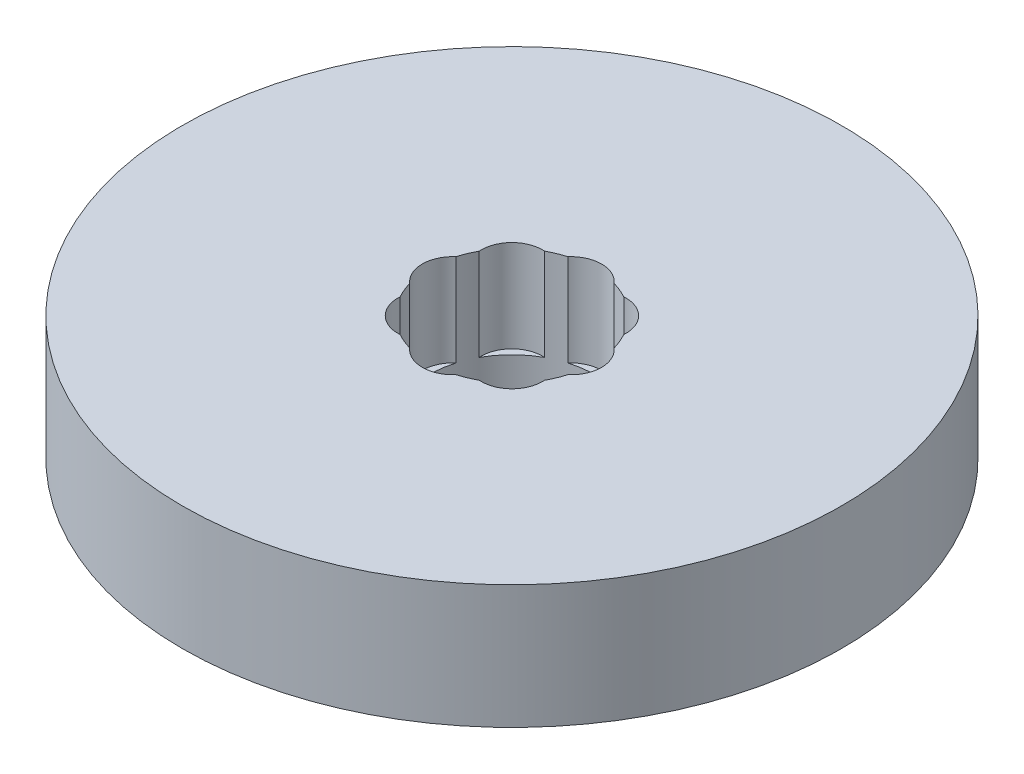
ISO-10303-21;
HEADER;
FILE_DESCRIPTION(('STEP AP214'),'2;1');
FILE_NAME('part.step','',(''),(''),'','','');
FILE_SCHEMA(('AUTOMOTIVE_DESIGN { 1 0 10303 214 1 1 1 1 }'));
ENDSEC;
DATA;
#1=APPLICATION_CONTEXT('core data for automotive mechanical design processes');
#2=APPLICATION_PROTOCOL_DEFINITION('international standard','automotive_design',2000,#1);
#3=PRODUCT_CONTEXT('',#1,'mechanical');
#4=PRODUCT('Part','Part','',(#3));
#5=PRODUCT_RELATED_PRODUCT_CATEGORY('part','',(#4));
#6=PRODUCT_DEFINITION_FORMATION('','',#4);
#7=PRODUCT_DEFINITION_CONTEXT('part definition',#1,'design');
#8=PRODUCT_DEFINITION('design','',#6,#7);
#9=PRODUCT_DEFINITION_SHAPE('','',#8);
#10=(LENGTH_UNIT() NAMED_UNIT(*) SI_UNIT(.MILLI.,.METRE.));
#11=(NAMED_UNIT(*) PLANE_ANGLE_UNIT() SI_UNIT($,.RADIAN.));
#12=(NAMED_UNIT(*) SI_UNIT($,.STERADIAN.) SOLID_ANGLE_UNIT());
#13=UNCERTAINTY_MEASURE_WITH_UNIT(LENGTH_MEASURE(1.E-05),#10,'distance_accuracy_value','');
#14=(GEOMETRIC_REPRESENTATION_CONTEXT(3) GLOBAL_UNCERTAINTY_ASSIGNED_CONTEXT((#13)) GLOBAL_UNIT_ASSIGNED_CONTEXT((#10,
#11,#12)) REPRESENTATION_CONTEXT('',''));
#15=CARTESIAN_POINT('',(0.,0.,0.));
#16=DIRECTION('',(0.,0.,1.));
#17=DIRECTION('',(1.,0.,0.));
#18=AXIS2_PLACEMENT_3D('',#15,#16,#17);
#19=CARTESIAN_POINT('',(0.,30.,0.));
#20=DIRECTION('',(0.,-1.,0.));
#21=DIRECTION('',(0.,0.,-1.));
#22=AXIS2_PLACEMENT_3D('',#19,#20,#21);
#23=CYLINDRICAL_SURFACE('',#22,80.);
#24=CARTESIAN_POINT('',(0.,30.,0.));
#25=DIRECTION('',(0.,1.,0.));
#26=DIRECTION('',(0.,0.,1.));
#27=AXIS2_PLACEMENT_3D('',#24,#25,#26);
#28=CIRCLE('',#27,80.);
#29=CARTESIAN_POINT('',(0.,30.,80.));
#30=VERTEX_POINT('',#29);
#31=EDGE_CURVE('E263',#30,#30,#28,.T.);
#32=ORIENTED_EDGE('',*,*,#31,.F.);
#33=EDGE_LOOP('',(#32));
#34=FACE_BOUND('',#33,.T.);
#35=CARTESIAN_POINT('',(0.,0.,0.));
#36=DIRECTION('',(0.,1.,0.));
#37=DIRECTION('',(0.,0.,1.));
#38=AXIS2_PLACEMENT_3D('',#35,#36,#37);
#39=CIRCLE('',#38,80.);
#40=CARTESIAN_POINT('',(0.,0.,80.));
#41=VERTEX_POINT('',#40);
#42=EDGE_CURVE('E256',#41,#41,#39,.T.);
#43=ORIENTED_EDGE('',*,*,#42,.T.);
#44=EDGE_LOOP('',(#43));
#45=FACE_BOUND('',#44,.T.);
#46=ADVANCED_FACE('F39',(#34,#45),#23,.T.);
#47=CARTESIAN_POINT('',(0.,30.,0.));
#48=DIRECTION('',(0.,1.,0.));
#49=DIRECTION('',(0.,0.,1.));
#50=AXIS2_PLACEMENT_3D('',#47,#48,#49);
#51=PLANE('',#50);
#52=CARTESIAN_POINT('',(-10.119499895816,30.,10.119499895816));
#53=DIRECTION('',(0.,1.,0.));
#54=DIRECTION('',(0.707106781186549,0.,0.707106781186546));
#55=AXIS2_PLACEMENT_3D('',#52,#53,#54);
#56=CIRCLE('',#55,7.44063860303872);
#57=CARTESIAN_POINT('',(-17.5423631982251,30.,9.60549287759661));
#58=VERTEX_POINT('',#57);
#59=CARTESIAN_POINT('',(-9.60549287759656,30.,17.5423631982251));
#60=VERTEX_POINT('',#59);
#61=EDGE_CURVE('E246',#58,#60,#56,.T.);
#62=ORIENTED_EDGE('',*,*,#61,.F.);
#63=CARTESIAN_POINT('',(0.,30.,0.));
#64=DIRECTION('',(0.,1.,0.));
#65=DIRECTION('',(0.,0.,1.));
#66=AXIS2_PLACEMENT_3D('',#63,#64,#65);
#67=CIRCLE('',#66,20.);
#68=CARTESIAN_POINT('',(-19.1964331258899,30.,5.61221482511465));
#69=VERTEX_POINT('',#68);
#70=EDGE_CURVE('E254',#69,#58,#67,.T.);
#71=ORIENTED_EDGE('',*,*,#70,.F.);
#72=CARTESIAN_POINT('',(-14.3111339970961,30.,0.));
#73=DIRECTION('',(0.,1.,0.));
#74=DIRECTION('',(0.,0.,1.));
#75=AXIS2_PLACEMENT_3D('',#72,#73,#74);
#76=CIRCLE('',#75,7.44063860303872);
#77=CARTESIAN_POINT('',(-19.1964331258899,30.,-5.61221482511465));
#78=VERTEX_POINT('',#77);
#79=EDGE_CURVE('E248',#78,#69,#76,.T.);
#80=ORIENTED_EDGE('',*,*,#79,.F.);
#81=CARTESIAN_POINT('',(-17.5423631982252,30.,-9.60549287759637));
#82=VERTEX_POINT('',#81);
#83=EDGE_CURVE('E257',#82,#78,#67,.T.);
#84=ORIENTED_EDGE('',*,*,#83,.F.);
#85=CARTESIAN_POINT('',(-10.1194998958161,30.,-10.1194998958159));
#86=DIRECTION('',(0.,1.,0.));
#87=DIRECTION('',(-0.707106781186539,0.,0.707106781186556));
#88=AXIS2_PLACEMENT_3D('',#85,#86,#87);
#89=CIRCLE('',#88,7.44063860303872);
#90=CARTESIAN_POINT('',(-9.6054928775968,30.,-17.542363198225));
#91=VERTEX_POINT('',#90);
#92=EDGE_CURVE('E58',#91,#82,#89,.T.);
#93=ORIENTED_EDGE('',*,*,#92,.F.);
#94=CARTESIAN_POINT('',(-5.61221482511485,30.,-19.1964331258899));
#95=VERTEX_POINT('',#94);
#96=EDGE_CURVE('E168',#95,#91,#67,.T.);
#97=ORIENTED_EDGE('',*,*,#96,.F.);
#98=CARTESIAN_POINT('',(-1.49901171865634E-13,30.,-14.3111339970961));
#99=DIRECTION('',(0.,1.,0.));
#100=DIRECTION('',(-1.,0.,0.));
#101=AXIS2_PLACEMENT_3D('',#98,#99,#100);
#102=CIRCLE('',#101,7.44063860303872);
#103=CARTESIAN_POINT('',(5.61221482511444,30.,-19.19643312589));
#104=VERTEX_POINT('',#103);
#105=EDGE_CURVE('E165',#104,#95,#102,.T.);
#106=ORIENTED_EDGE('',*,*,#105,.F.);
#107=CARTESIAN_POINT('',(9.60549287759644,30.,-17.5423631982252));
#108=VERTEX_POINT('',#107);
#109=EDGE_CURVE('E604',#108,#104,#67,.T.);
#110=ORIENTED_EDGE('',*,*,#109,.F.);
#111=CARTESIAN_POINT('',(10.1194998958159,30.,-10.1194998958161));
#112=DIRECTION('',(0.,1.,0.));
#113=DIRECTION('',(-0.707106781186554,0.,-0.707106781186541));
#114=AXIS2_PLACEMENT_3D('',#111,#112,#113);
#115=CIRCLE('',#114,7.44063860303872);
#116=CARTESIAN_POINT('',(17.542363198225,30.,-9.60549287759674));
#117=VERTEX_POINT('',#116);
#118=EDGE_CURVE('E224',#117,#108,#115,.T.);
#119=ORIENTED_EDGE('',*,*,#118,.F.);
#120=CARTESIAN_POINT('',(19.1964331258899,30.,-5.61221482511465));
#121=VERTEX_POINT('',#120);
#122=EDGE_CURVE('E605',#121,#117,#67,.T.);
#123=ORIENTED_EDGE('',*,*,#122,.F.);
#124=CARTESIAN_POINT('',(14.3111339970961,30.,0.));
#125=DIRECTION('',(0.,1.,0.));
#126=DIRECTION('',(0.,0.,-1.));
#127=AXIS2_PLACEMENT_3D('',#124,#125,#126);
#128=CIRCLE('',#127,7.44063860303872);
#129=CARTESIAN_POINT('',(19.1964331258899,30.,5.61221482511465));
#130=VERTEX_POINT('',#129);
#131=EDGE_CURVE('E231',#130,#121,#128,.T.);
#132=ORIENTED_EDGE('',*,*,#131,.F.);
#133=CARTESIAN_POINT('',(17.5423631982251,30.,9.60549287759649));
#134=VERTEX_POINT('',#133);
#135=EDGE_CURVE('E599',#134,#130,#67,.T.);
#136=ORIENTED_EDGE('',*,*,#135,.F.);
#137=CARTESIAN_POINT('',(10.1194998958161,30.,10.119499895816));
#138=DIRECTION('',(0.,1.,0.));
#139=DIRECTION('',(0.707106781186544,0.,-0.707106781186551));
#140=AXIS2_PLACEMENT_3D('',#137,#138,#139);
#141=CIRCLE('',#140,7.44063860303872);
#142=CARTESIAN_POINT('',(9.60549287759668,30.,17.542363198225));
#143=VERTEX_POINT('',#142);
#144=EDGE_CURVE('E237',#143,#134,#141,.T.);
#145=ORIENTED_EDGE('',*,*,#144,.F.);
#146=CARTESIAN_POINT('',(5.61221482511472,30.,19.1964331258899));
#147=VERTEX_POINT('',#146);
#148=EDGE_CURVE('E598',#147,#143,#67,.T.);
#149=ORIENTED_EDGE('',*,*,#148,.F.);
#150=CARTESIAN_POINT('',(0.,30.,14.3111339970961));
#151=DIRECTION('',(0.,1.,0.));
#152=DIRECTION('',(1.,0.,0.));
#153=AXIS2_PLACEMENT_3D('',#150,#151,#152);
#154=CIRCLE('',#153,7.44063860303872);
#155=CARTESIAN_POINT('',(-5.61221482511458,30.,19.1964331258899));
#156=VERTEX_POINT('',#155);
#157=EDGE_CURVE('E241',#156,#147,#154,.T.);
#158=ORIENTED_EDGE('',*,*,#157,.F.);
#159=EDGE_CURVE('E259',#60,#156,#67,.T.);
#160=ORIENTED_EDGE('',*,*,#159,.F.);
#161=EDGE_LOOP('',(#62,#71,#80,#84,#93,#97,#106,#110,#119,#123,#132,#136,#145,#149,#158,#160));
#162=FACE_BOUND('',#161,.T.);
#163=ORIENTED_EDGE('',*,*,#31,.T.);
#164=EDGE_LOOP('',(#163));
#165=FACE_BOUND('',#164,.T.);
#166=ADVANCED_FACE('F286',(#162,#165),#51,.T.);
#167=CARTESIAN_POINT('',(0.,0.,0.));
#168=DIRECTION('',(0.,1.,0.));
#169=DIRECTION('',(0.,0.,1.));
#170=AXIS2_PLACEMENT_3D('',#167,#168,#169);
#171=PLANE('',#170);
#172=CARTESIAN_POINT('',(0.,0.,0.));
#173=DIRECTION('',(0.,1.,0.));
#174=DIRECTION('',(0.,0.,1.));
#175=AXIS2_PLACEMENT_3D('',#172,#173,#174);
#176=CIRCLE('',#175,20.);
#177=CARTESIAN_POINT('',(0.,0.,20.));
#178=VERTEX_POINT('',#177);
#179=EDGE_CURVE('E251',#178,#178,#176,.T.);
#180=ORIENTED_EDGE('',*,*,#179,.T.);
#181=EDGE_LOOP('',(#180));
#182=FACE_BOUND('',#181,.T.);
#183=ORIENTED_EDGE('',*,*,#42,.F.);
#184=EDGE_LOOP('',(#183));
#185=FACE_BOUND('',#184,.T.);
#186=ADVANCED_FACE('F308',(#182,#185),#171,.F.);
#187=CARTESIAN_POINT('',(0.,30.,0.));
#188=DIRECTION('',(0.,-1.,0.));
#189=DIRECTION('',(0.,0.,-1.));
#190=AXIS2_PLACEMENT_3D('',#187,#188,#189);
#191=CYLINDRICAL_SURFACE('',#190,20.);
#192=DIRECTION('',(0.,1.,0.));
#193=VECTOR('',#192,1.);
#194=CARTESIAN_POINT('',(-17.5423631982251,18.8274734415724,9.60549287759662));
#195=LINE('',#194,#193);
#196=CARTESIAN_POINT('',(-17.5423631982251,7.65494688314487,9.60549287759661));
#197=VERTEX_POINT('',#196);
#198=EDGE_CURVE('E11',#197,#58,#195,.T.);
#199=ORIENTED_EDGE('',*,*,#198,.F.);
#200=CARTESIAN_POINT('',(0.,7.65494688314487,0.));
#201=DIRECTION('',(0.,1.,0.));
#202=DIRECTION('',(0.,0.,1.));
#203=AXIS2_PLACEMENT_3D('',#200,#201,#202);
#204=CIRCLE('',#203,20.);
#205=CARTESIAN_POINT('',(-9.60549287759656,7.65494688314487,17.5423631982251));
#206=VERTEX_POINT('',#205);
#207=EDGE_CURVE('E157',#197,#206,#204,.T.);
#208=ORIENTED_EDGE('',*,*,#207,.T.);
#209=DIRECTION('',(0.,1.,0.));
#210=VECTOR('',#209,1.);
#211=CARTESIAN_POINT('',(-9.60549287759656,18.8274734415724,17.5423631982251));
#212=LINE('',#211,#210);
#213=EDGE_CURVE('E46',#60,#206,#212,.F.);
#214=ORIENTED_EDGE('',*,*,#213,.F.);
#215=ORIENTED_EDGE('',*,*,#159,.T.);
#216=DIRECTION('',(0.,1.,0.));
#217=VECTOR('',#216,1.);
#218=CARTESIAN_POINT('',(-5.61221482511458,18.8274734415724,19.1964331258899));
#219=LINE('',#218,#217);
#220=CARTESIAN_POINT('',(-5.61221482511458,7.65494688314487,19.1964331258899));
#221=VERTEX_POINT('',#220);
#222=EDGE_CURVE('E198',#221,#156,#219,.T.);
#223=ORIENTED_EDGE('',*,*,#222,.F.);
#224=CARTESIAN_POINT('',(5.61221482511472,7.65494688314487,19.1964331258899));
#225=VERTEX_POINT('',#224);
#226=EDGE_CURVE('E194',#221,#225,#204,.T.);
#227=ORIENTED_EDGE('',*,*,#226,.T.);
#228=DIRECTION('',(0.,1.,0.));
#229=VECTOR('',#228,1.);
#230=CARTESIAN_POINT('',(5.61221482511472,18.8274734415724,19.1964331258899));
#231=LINE('',#230,#229);
#232=EDGE_CURVE('E192',#147,#225,#231,.F.);
#233=ORIENTED_EDGE('',*,*,#232,.F.);
#234=ORIENTED_EDGE('',*,*,#148,.T.);
#235=DIRECTION('',(0.,1.,0.));
#236=VECTOR('',#235,1.);
#237=CARTESIAN_POINT('',(9.60549287759668,18.8274734415724,17.542363198225));
#238=LINE('',#237,#236);
#239=CARTESIAN_POINT('',(9.60549287759668,7.65494688314487,17.542363198225));
#240=VERTEX_POINT('',#239);
#241=EDGE_CURVE('E191',#240,#143,#238,.T.);
#242=ORIENTED_EDGE('',*,*,#241,.F.);
#243=CARTESIAN_POINT('',(17.5423631982251,7.65494688314487,9.60549287759649));
#244=VERTEX_POINT('',#243);
#245=EDGE_CURVE('E189',#240,#244,#204,.T.);
#246=ORIENTED_EDGE('',*,*,#245,.T.);
#247=DIRECTION('',(0.,1.,0.));
#248=VECTOR('',#247,1.);
#249=CARTESIAN_POINT('',(17.5423631982251,18.8274734415724,9.60549287759649));
#250=LINE('',#249,#248);
#251=EDGE_CURVE('E187',#134,#244,#250,.F.);
#252=ORIENTED_EDGE('',*,*,#251,.F.);
#253=ORIENTED_EDGE('',*,*,#135,.T.);
#254=DIRECTION('',(0.,1.,0.));
#255=VECTOR('',#254,1.);
#256=CARTESIAN_POINT('',(19.1964331258899,18.8274734415724,5.61221482511465));
#257=LINE('',#256,#255);
#258=CARTESIAN_POINT('',(19.1964331258899,7.65494688314487,5.61221482511465));
#259=VERTEX_POINT('',#258);
#260=EDGE_CURVE('E186',#259,#130,#257,.T.);
#261=ORIENTED_EDGE('',*,*,#260,.F.);
#262=CARTESIAN_POINT('',(19.1964331258899,7.65494688314487,-5.61221482511465));
#263=VERTEX_POINT('',#262);
#264=EDGE_CURVE('E183',#259,#263,#204,.T.);
#265=ORIENTED_EDGE('',*,*,#264,.T.);
#266=DIRECTION('',(0.,1.,0.));
#267=VECTOR('',#266,1.);
#268=CARTESIAN_POINT('',(19.1964331258899,18.8274734415724,-5.61221482511465));
#269=LINE('',#268,#267);
#270=EDGE_CURVE('E181',#121,#263,#269,.F.);
#271=ORIENTED_EDGE('',*,*,#270,.F.);
#272=ORIENTED_EDGE('',*,*,#122,.T.);
#273=DIRECTION('',(0.,1.,0.));
#274=VECTOR('',#273,1.);
#275=CARTESIAN_POINT('',(17.542363198225,18.8274734415724,-9.60549287759674));
#276=LINE('',#275,#274);
#277=CARTESIAN_POINT('',(17.542363198225,7.65494688314487,-9.60549287759674));
#278=VERTEX_POINT('',#277);
#279=EDGE_CURVE('E182',#278,#117,#276,.T.);
#280=ORIENTED_EDGE('',*,*,#279,.F.);
#281=CARTESIAN_POINT('',(9.60549287759644,7.65494688314487,-17.5423631982252));
#282=VERTEX_POINT('',#281);
#283=EDGE_CURVE('E179',#278,#282,#204,.T.);
#284=ORIENTED_EDGE('',*,*,#283,.T.);
#285=DIRECTION('',(0.,1.,0.));
#286=VECTOR('',#285,1.);
#287=CARTESIAN_POINT('',(9.60549287759644,18.8274734415724,-17.5423631982252));
#288=LINE('',#287,#286);
#289=EDGE_CURVE('E177',#108,#282,#288,.F.);
#290=ORIENTED_EDGE('',*,*,#289,.F.);
#291=ORIENTED_EDGE('',*,*,#109,.T.);
#292=DIRECTION('',(0.,1.,0.));
#293=VECTOR('',#292,1.);
#294=CARTESIAN_POINT('',(5.61221482511445,18.8274734415724,-19.19643312589));
#295=LINE('',#294,#293);
#296=CARTESIAN_POINT('',(5.61221482511444,7.65494688314487,-19.19643312589));
#297=VERTEX_POINT('',#296);
#298=EDGE_CURVE('E176',#297,#104,#295,.T.);
#299=ORIENTED_EDGE('',*,*,#298,.F.);
#300=CARTESIAN_POINT('',(-5.61221482511485,7.65494688314487,-19.1964331258899));
#301=VERTEX_POINT('',#300);
#302=EDGE_CURVE('E159',#297,#301,#204,.T.);
#303=ORIENTED_EDGE('',*,*,#302,.T.);
#304=DIRECTION('',(0.,1.,0.));
#305=VECTOR('',#304,1.);
#306=CARTESIAN_POINT('',(-5.61221482511485,18.8274734415724,-19.1964331258899));
#307=LINE('',#306,#305);
#308=EDGE_CURVE('E171',#95,#301,#307,.F.);
#309=ORIENTED_EDGE('',*,*,#308,.F.);
#310=ORIENTED_EDGE('',*,*,#96,.T.);
#311=DIRECTION('',(0.,1.,0.));
#312=VECTOR('',#311,1.);
#313=CARTESIAN_POINT('',(-9.6054928775968,18.8274734415724,-17.542363198225));
#314=LINE('',#313,#312);
#315=CARTESIAN_POINT('',(-9.6054928775968,7.65494688314487,-17.542363198225));
#316=VERTEX_POINT('',#315);
#317=EDGE_CURVE('E156',#316,#91,#314,.T.);
#318=ORIENTED_EDGE('',*,*,#317,.F.);
#319=CARTESIAN_POINT('',(-17.5423631982252,7.65494688314487,-9.60549287759637));
#320=VERTEX_POINT('',#319);
#321=EDGE_CURVE('E147',#316,#320,#204,.T.);
#322=ORIENTED_EDGE('',*,*,#321,.T.);
#323=DIRECTION('',(0.,1.,0.));
#324=VECTOR('',#323,1.);
#325=CARTESIAN_POINT('',(-17.5423631982252,18.8274734415724,-9.60549287759637));
#326=LINE('',#325,#324);
#327=EDGE_CURVE('E160',#82,#320,#326,.F.);
#328=ORIENTED_EDGE('',*,*,#327,.F.);
#329=ORIENTED_EDGE('',*,*,#83,.T.);
#330=DIRECTION('',(0.,1.,0.));
#331=VECTOR('',#330,1.);
#332=CARTESIAN_POINT('',(-19.1964331258899,18.8274734415724,-5.61221482511465));
#333=LINE('',#332,#331);
#334=CARTESIAN_POINT('',(-19.1964331258899,7.65494688314487,-5.61221482511465));
#335=VERTEX_POINT('',#334);
#336=EDGE_CURVE('E273',#335,#78,#333,.T.);
#337=ORIENTED_EDGE('',*,*,#336,.F.);
#338=CARTESIAN_POINT('',(0.,7.65494688314487,0.));
#339=DIRECTION('',(0.,1.,0.));
#340=DIRECTION('',(0.,0.,1.));
#341=AXIS2_PLACEMENT_3D('',#338,#339,#340);
#342=CIRCLE('',#341,20.);
#343=CARTESIAN_POINT('',(-19.1964331258899,7.65494688314487,5.61221482511465));
#344=VERTEX_POINT('',#343);
#345=EDGE_CURVE('E266',#335,#344,#342,.T.);
#346=ORIENTED_EDGE('',*,*,#345,.T.);
#347=DIRECTION('',(0.,1.,0.));
#348=VECTOR('',#347,1.);
#349=CARTESIAN_POINT('',(-19.1964331258899,18.8274734415724,5.61221482511465));
#350=LINE('',#349,#348);
#351=EDGE_CURVE('E271',#69,#344,#350,.F.);
#352=ORIENTED_EDGE('',*,*,#351,.F.);
#353=ORIENTED_EDGE('',*,*,#70,.T.);
#354=EDGE_LOOP('',(#199,#208,#214,#215,#223,#227,#233,#234,#242,#246,#252,#253,#261,#265,#271,
#272,#280,#284,#290,#291,#299,#303,#309,#310,#318,#322,#328,#329,#337,#346,#352,#353));
#355=FACE_BOUND('',#354,.T.);
#356=ORIENTED_EDGE('',*,*,#179,.F.);
#357=EDGE_LOOP('',(#356));
#358=FACE_BOUND('',#357,.T.);
#359=ADVANCED_FACE('F167',(#355,#358),#191,.F.);
#360=CARTESIAN_POINT('',(-14.3111339970961,7.65494688314487,0.));
#361=DIRECTION('',(0.,1.,0.));
#362=DIRECTION('',(0.,0.,1.));
#363=AXIS2_PLACEMENT_3D('',#360,#361,#362);
#364=CYLINDRICAL_SURFACE('',#363,7.44063860303872);
#365=ORIENTED_EDGE('',*,*,#336,.T.);
#366=ORIENTED_EDGE('',*,*,#79,.T.);
#367=ORIENTED_EDGE('',*,*,#351,.T.);
#368=CARTESIAN_POINT('',(-14.3111339970961,7.65494688314487,0.));
#369=DIRECTION('',(0.,1.,0.));
#370=DIRECTION('',(0.,0.,1.));
#371=AXIS2_PLACEMENT_3D('',#368,#369,#370);
#372=CIRCLE('',#371,7.44063860303872);
#373=EDGE_CURVE('E253',#335,#344,#372,.T.);
#374=ORIENTED_EDGE('',*,*,#373,.F.);
#375=EDGE_LOOP('',(#365,#366,#367,#374));
#376=FACE_BOUND('',#375,.T.);
#377=ADVANCED_FACE('F278',(#376),#364,.F.);
#378=CARTESIAN_POINT('',(-14.3111339970961,7.65494688314487,0.));
#379=DIRECTION('',(0.,1.,0.));
#380=DIRECTION('',(0.,0.,1.));
#381=AXIS2_PLACEMENT_3D('',#378,#379,#380);
#382=PLANE('',#381);
#383=ORIENTED_EDGE('',*,*,#373,.T.);
#384=ORIENTED_EDGE('',*,*,#345,.F.);
#385=EDGE_LOOP('',(#383,#384));
#386=FACE_BOUND('',#385,.T.);
#387=ADVANCED_FACE('F289',(#386),#382,.T.);
#388=CARTESIAN_POINT('',(-10.1194998958161,7.65494688314487,-10.1194998958159));
#389=DIRECTION('',(0.,1.,0.));
#390=DIRECTION('',(0.,0.,1.));
#391=AXIS2_PLACEMENT_3D('',#388,#389,#390);
#392=CYLINDRICAL_SURFACE('',#391,7.44063860303872);
#393=ORIENTED_EDGE('',*,*,#317,.T.);
#394=ORIENTED_EDGE('',*,*,#92,.T.);
#395=ORIENTED_EDGE('',*,*,#327,.T.);
#396=CARTESIAN_POINT('',(-10.1194998958161,7.65494688314487,-10.1194998958159));
#397=DIRECTION('',(0.,1.,0.));
#398=DIRECTION('',(-0.707106781186539,0.,0.707106781186556));
#399=AXIS2_PLACEMENT_3D('',#396,#397,#398);
#400=CIRCLE('',#399,7.44063860303872);
#401=EDGE_CURVE('E153',#316,#320,#400,.T.);
#402=ORIENTED_EDGE('',*,*,#401,.F.);
#403=EDGE_LOOP('',(#393,#394,#395,#402));
#404=FACE_BOUND('',#403,.T.);
#405=ADVANCED_FACE('F161',(#404),#392,.F.);
#406=CARTESIAN_POINT('',(-10.119499895816,7.65494688314487,10.119499895816));
#407=DIRECTION('',(0.,1.,0.));
#408=DIRECTION('',(0.707106781186549,0.,0.707106781186546));
#409=AXIS2_PLACEMENT_3D('',#406,#407,#408);
#410=PLANE('',#409);
#411=ORIENTED_EDGE('',*,*,#401,.T.);
#412=ORIENTED_EDGE('',*,*,#321,.F.);
#413=EDGE_LOOP('',(#411,#412));
#414=FACE_BOUND('',#413,.T.);
#415=ADVANCED_FACE('F155',(#414),#410,.T.);
#416=CARTESIAN_POINT('',(-1.49901171865634E-13,7.65494688314487,-14.3111339970961));
#417=DIRECTION('',(0.,1.,0.));
#418=DIRECTION('',(0.,0.,1.));
#419=AXIS2_PLACEMENT_3D('',#416,#417,#418);
#420=CYLINDRICAL_SURFACE('',#419,7.44063860303872);
#421=ORIENTED_EDGE('',*,*,#298,.T.);
#422=ORIENTED_EDGE('',*,*,#105,.T.);
#423=ORIENTED_EDGE('',*,*,#308,.T.);
#424=CARTESIAN_POINT('',(-1.49901171865634E-13,7.65494688314487,-14.3111339970961));
#425=DIRECTION('',(0.,1.,0.));
#426=DIRECTION('',(-1.,0.,0.));
#427=AXIS2_PLACEMENT_3D('',#424,#425,#426);
#428=CIRCLE('',#427,7.44063860303872);
#429=EDGE_CURVE('E218',#297,#301,#428,.T.);
#430=ORIENTED_EDGE('',*,*,#429,.F.);
#431=EDGE_LOOP('',(#421,#422,#423,#430));
#432=FACE_BOUND('',#431,.T.);
#433=ADVANCED_FACE('F222',(#432),#420,.F.);
#434=ORIENTED_EDGE('',*,*,#429,.T.);
#435=ORIENTED_EDGE('',*,*,#302,.F.);
#436=EDGE_LOOP('',(#434,#435));
#437=FACE_BOUND('',#436,.T.);
#438=ADVANCED_FACE('F217',(#437),#410,.T.);
#439=CARTESIAN_POINT('',(10.1194998958159,7.65494688314487,-10.1194998958161));
#440=DIRECTION('',(0.,1.,0.));
#441=DIRECTION('',(0.,0.,1.));
#442=AXIS2_PLACEMENT_3D('',#439,#440,#441);
#443=CYLINDRICAL_SURFACE('',#442,7.44063860303872);
#444=ORIENTED_EDGE('',*,*,#279,.T.);
#445=ORIENTED_EDGE('',*,*,#118,.T.);
#446=ORIENTED_EDGE('',*,*,#289,.T.);
#447=CARTESIAN_POINT('',(10.1194998958159,7.65494688314487,-10.1194998958161));
#448=DIRECTION('',(0.,1.,0.));
#449=DIRECTION('',(-0.707106781186554,0.,-0.707106781186541));
#450=AXIS2_PLACEMENT_3D('',#447,#448,#449);
#451=CIRCLE('',#450,7.44063860303872);
#452=EDGE_CURVE('E223',#278,#282,#451,.T.);
#453=ORIENTED_EDGE('',*,*,#452,.F.);
#454=EDGE_LOOP('',(#444,#445,#446,#453));
#455=FACE_BOUND('',#454,.T.);
#456=ADVANCED_FACE('F355',(#455),#443,.F.);
#457=ORIENTED_EDGE('',*,*,#452,.T.);
#458=ORIENTED_EDGE('',*,*,#283,.F.);
#459=EDGE_LOOP('',(#457,#458));
#460=FACE_BOUND('',#459,.T.);
#461=ADVANCED_FACE('F352',(#460),#410,.T.);
#462=CARTESIAN_POINT('',(14.3111339970961,7.65494688314487,0.));
#463=DIRECTION('',(0.,1.,0.));
#464=DIRECTION('',(0.,0.,1.));
#465=AXIS2_PLACEMENT_3D('',#462,#463,#464);
#466=CYLINDRICAL_SURFACE('',#465,7.44063860303872);
#467=ORIENTED_EDGE('',*,*,#260,.T.);
#468=ORIENTED_EDGE('',*,*,#131,.T.);
#469=ORIENTED_EDGE('',*,*,#270,.T.);
#470=CARTESIAN_POINT('',(14.3111339970961,7.65494688314487,0.));
#471=DIRECTION('',(0.,1.,0.));
#472=DIRECTION('',(0.,0.,-1.));
#473=AXIS2_PLACEMENT_3D('',#470,#471,#472);
#474=CIRCLE('',#473,7.44063860303872);
#475=EDGE_CURVE('E232',#259,#263,#474,.T.);
#476=ORIENTED_EDGE('',*,*,#475,.F.);
#477=EDGE_LOOP('',(#467,#468,#469,#476));
#478=FACE_BOUND('',#477,.T.);
#479=ADVANCED_FACE('F369',(#478),#466,.F.);
#480=ORIENTED_EDGE('',*,*,#475,.T.);
#481=ORIENTED_EDGE('',*,*,#264,.F.);
#482=EDGE_LOOP('',(#480,#481));
#483=FACE_BOUND('',#482,.T.);
#484=ADVANCED_FACE('F371',(#483),#410,.T.);
#485=CARTESIAN_POINT('',(10.1194998958161,7.65494688314487,10.119499895816));
#486=DIRECTION('',(0.,1.,0.));
#487=DIRECTION('',(0.,0.,1.));
#488=AXIS2_PLACEMENT_3D('',#485,#486,#487);
#489=CYLINDRICAL_SURFACE('',#488,7.44063860303872);
#490=ORIENTED_EDGE('',*,*,#241,.T.);
#491=ORIENTED_EDGE('',*,*,#144,.T.);
#492=ORIENTED_EDGE('',*,*,#251,.T.);
#493=CARTESIAN_POINT('',(10.1194998958161,7.65494688314487,10.119499895816));
#494=DIRECTION('',(0.,1.,0.));
#495=DIRECTION('',(0.707106781186544,0.,-0.707106781186551));
#496=AXIS2_PLACEMENT_3D('',#493,#494,#495);
#497=CIRCLE('',#496,7.44063860303872);
#498=EDGE_CURVE('E236',#240,#244,#497,.T.);
#499=ORIENTED_EDGE('',*,*,#498,.F.);
#500=EDGE_LOOP('',(#490,#491,#492,#499));
#501=FACE_BOUND('',#500,.T.);
#502=ADVANCED_FACE('F390',(#501),#489,.F.);
#503=ORIENTED_EDGE('',*,*,#498,.T.);
#504=ORIENTED_EDGE('',*,*,#245,.F.);
#505=EDGE_LOOP('',(#503,#504));
#506=FACE_BOUND('',#505,.T.);
#507=ADVANCED_FACE('F386',(#506),#410,.T.);
#508=CARTESIAN_POINT('',(0.,7.65494688314487,14.3111339970961));
#509=DIRECTION('',(0.,1.,0.));
#510=DIRECTION('',(0.,0.,1.));
#511=AXIS2_PLACEMENT_3D('',#508,#509,#510);
#512=CYLINDRICAL_SURFACE('',#511,7.44063860303872);
#513=ORIENTED_EDGE('',*,*,#222,.T.);
#514=ORIENTED_EDGE('',*,*,#157,.T.);
#515=ORIENTED_EDGE('',*,*,#232,.T.);
#516=CARTESIAN_POINT('',(0.,7.65494688314487,14.3111339970961));
#517=DIRECTION('',(0.,1.,0.));
#518=DIRECTION('',(1.,0.,0.));
#519=AXIS2_PLACEMENT_3D('',#516,#517,#518);
#520=CIRCLE('',#519,7.44063860303872);
#521=EDGE_CURVE('E242',#221,#225,#520,.T.);
#522=ORIENTED_EDGE('',*,*,#521,.F.);
#523=EDGE_LOOP('',(#513,#514,#515,#522));
#524=FACE_BOUND('',#523,.T.);
#525=ADVANCED_FACE('F403',(#524),#512,.F.);
#526=ORIENTED_EDGE('',*,*,#521,.T.);
#527=ORIENTED_EDGE('',*,*,#226,.F.);
#528=EDGE_LOOP('',(#526,#527));
#529=FACE_BOUND('',#528,.T.);
#530=ADVANCED_FACE('F410',(#529),#410,.T.);
#531=CARTESIAN_POINT('',(-10.119499895816,7.65494688314487,10.119499895816));
#532=DIRECTION('',(0.,1.,0.));
#533=DIRECTION('',(0.707106781186549,0.,0.707106781186546));
#534=AXIS2_PLACEMENT_3D('',#531,#532,#533);
#535=CIRCLE('',#534,7.44063860303872);
#536=EDGE_CURVE('E55',#197,#206,#535,.T.);
#537=ORIENTED_EDGE('',*,*,#536,.T.);
#538=ORIENTED_EDGE('',*,*,#207,.F.);
#539=EDGE_LOOP('',(#537,#538));
#540=FACE_BOUND('',#539,.T.);
#541=ADVANCED_FACE('F340',(#540),#410,.T.);
#542=CARTESIAN_POINT('',(-10.119499895816,7.65494688314487,10.119499895816));
#543=DIRECTION('',(0.,1.,0.));
#544=DIRECTION('',(0.,0.,1.));
#545=AXIS2_PLACEMENT_3D('',#542,#543,#544);
#546=CYLINDRICAL_SURFACE('',#545,7.44063860303872);
#547=ORIENTED_EDGE('',*,*,#198,.T.);
#548=ORIENTED_EDGE('',*,*,#61,.T.);
#549=ORIENTED_EDGE('',*,*,#213,.T.);
#550=ORIENTED_EDGE('',*,*,#536,.F.);
#551=EDGE_LOOP('',(#547,#548,#549,#550));
#552=FACE_BOUND('',#551,.T.);
#553=ADVANCED_FACE('F431',(#552),#546,.F.);
#554=CLOSED_SHELL('',(#46,#166,#186,#359,#377,#387,#405,#415,#433,#438,#456,#461,#479,#484,#502,
#507,#525,#530,#541,#553));
#555=MANIFOLD_SOLID_BREP('B2',#554);
#556=ADVANCED_BREP_SHAPE_REPRESENTATION('',(#18,#555),#14);
#557=SHAPE_DEFINITION_REPRESENTATION(#9,#556);
ENDSEC;
END-ISO-10303-21;
